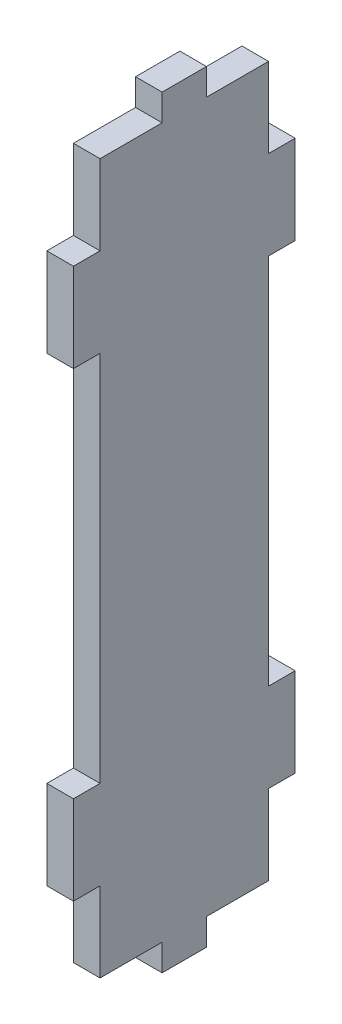
ISO-10303-21;
HEADER;
FILE_DESCRIPTION(('STEP AP214'),'2;1');
FILE_NAME('part.step','',(''),(''),'','','');
FILE_SCHEMA(('AUTOMOTIVE_DESIGN { 1 0 10303 214 1 1 1 1 }'));
ENDSEC;
DATA;
#1=APPLICATION_CONTEXT('core data for automotive mechanical design processes');
#2=APPLICATION_PROTOCOL_DEFINITION('international standard','automotive_design',2000,#1);
#3=PRODUCT_CONTEXT('',#1,'mechanical');
#4=PRODUCT('Part','Part','',(#3));
#5=PRODUCT_RELATED_PRODUCT_CATEGORY('part','',(#4));
#6=PRODUCT_DEFINITION_FORMATION('','',#4);
#7=PRODUCT_DEFINITION_CONTEXT('part definition',#1,'design');
#8=PRODUCT_DEFINITION('design','',#6,#7);
#9=PRODUCT_DEFINITION_SHAPE('','',#8);
#10=(LENGTH_UNIT() NAMED_UNIT(*) SI_UNIT(.MILLI.,.METRE.));
#11=(NAMED_UNIT(*) PLANE_ANGLE_UNIT() SI_UNIT($,.RADIAN.));
#12=(NAMED_UNIT(*) SI_UNIT($,.STERADIAN.) SOLID_ANGLE_UNIT());
#13=UNCERTAINTY_MEASURE_WITH_UNIT(LENGTH_MEASURE(1.E-05),#10,'distance_accuracy_value','');
#14=(GEOMETRIC_REPRESENTATION_CONTEXT(3) GLOBAL_UNCERTAINTY_ASSIGNED_CONTEXT((#13)) GLOBAL_UNIT_ASSIGNED_CONTEXT((#10,
#11,#12)) REPRESENTATION_CONTEXT('',''));
#15=CARTESIAN_POINT('',(0.,0.,0.));
#16=DIRECTION('',(0.,0.,1.));
#17=DIRECTION('',(1.,0.,0.));
#18=AXIS2_PLACEMENT_3D('',#15,#16,#17);
#19=CARTESIAN_POINT('',(3.,0.,0.));
#20=DIRECTION('',(0.,1.,0.));
#21=DIRECTION('',(0.,0.,1.));
#22=AXIS2_PLACEMENT_3D('',#19,#20,#21);
#23=PLANE('',#22);
#24=DIRECTION('',(0.,0.,-1.));
#25=VECTOR('',#24,1.);
#26=CARTESIAN_POINT('',(3.,0.,0.));
#27=LINE('',#26,#25);
#28=CARTESIAN_POINT('',(3.,0.,-10.));
#29=VERTEX_POINT('',#28);
#30=CARTESIAN_POINT('',(3.,0.,-15.));
#31=VERTEX_POINT('',#30);
#32=EDGE_CURVE('E418',#29,#31,#27,.T.);
#33=ORIENTED_EDGE('',*,*,#32,.F.);
#34=DIRECTION('',(1.,0.,0.));
#35=VECTOR('',#34,1.);
#36=CARTESIAN_POINT('',(0.,0.,-10.));
#37=LINE('',#36,#35);
#38=CARTESIAN_POINT('',(0.,0.,-10.));
#39=VERTEX_POINT('',#38);
#40=EDGE_CURVE('E284',#39,#29,#37,.T.);
#41=ORIENTED_EDGE('',*,*,#40,.F.);
#42=DIRECTION('',(0.,0.,-1.));
#43=VECTOR('',#42,1.);
#44=CARTESIAN_POINT('',(0.,0.,0.));
#45=LINE('',#44,#43);
#46=CARTESIAN_POINT('',(0.,0.,-15.));
#47=VERTEX_POINT('',#46);
#48=EDGE_CURVE('E427',#39,#47,#45,.T.);
#49=ORIENTED_EDGE('',*,*,#48,.T.);
#50=DIRECTION('',(1.,0.,0.));
#51=VECTOR('',#50,1.);
#52=CARTESIAN_POINT('',(0.,0.,-15.));
#53=LINE('',#52,#51);
#54=EDGE_CURVE('E227',#47,#31,#53,.T.);
#55=ORIENTED_EDGE('',*,*,#54,.T.);
#56=EDGE_LOOP('',(#33,#41,#49,#55));
#57=FACE_BOUND('',#56,.T.);
#58=ADVANCED_FACE('F34',(#57),#23,.F.);
#59=CARTESIAN_POINT('',(3.,86.,0.));
#60=DIRECTION('',(0.,-1.,0.));
#61=DIRECTION('',(0.,0.,-1.));
#62=AXIS2_PLACEMENT_3D('',#59,#60,#61);
#63=PLANE('',#62);
#64=DIRECTION('',(0.,0.,1.));
#65=VECTOR('',#64,1.);
#66=CARTESIAN_POINT('',(3.,86.,0.));
#67=LINE('',#66,#65);
#68=CARTESIAN_POINT('',(3.,86.,-15.));
#69=VERTEX_POINT('',#68);
#70=CARTESIAN_POINT('',(3.,86.,-10.));
#71=VERTEX_POINT('',#70);
#72=EDGE_CURVE('E12',#69,#71,#67,.T.);
#73=ORIENTED_EDGE('',*,*,#72,.F.);
#74=DIRECTION('',(1.,0.,0.));
#75=VECTOR('',#74,1.);
#76=CARTESIAN_POINT('',(0.,86.,-15.));
#77=LINE('',#76,#75);
#78=CARTESIAN_POINT('',(0.,86.,-15.));
#79=VERTEX_POINT('',#78);
#80=EDGE_CURVE('E260',#79,#69,#77,.T.);
#81=ORIENTED_EDGE('',*,*,#80,.F.);
#82=DIRECTION('',(0.,0.,1.));
#83=VECTOR('',#82,1.);
#84=CARTESIAN_POINT('',(0.,86.,0.));
#85=LINE('',#84,#83);
#86=CARTESIAN_POINT('',(0.,86.,-10.));
#87=VERTEX_POINT('',#86);
#88=EDGE_CURVE('E38',#79,#87,#85,.T.);
#89=ORIENTED_EDGE('',*,*,#88,.T.);
#90=DIRECTION('',(1.,0.,0.));
#91=VECTOR('',#90,1.);
#92=CARTESIAN_POINT('',(0.,86.,-10.));
#93=LINE('',#92,#91);
#94=EDGE_CURVE('E291',#87,#71,#93,.T.);
#95=ORIENTED_EDGE('',*,*,#94,.T.);
#96=EDGE_LOOP('',(#73,#81,#89,#95));
#97=FACE_BOUND('',#96,.T.);
#98=ADVANCED_FACE('F443',(#97),#63,.F.);
#99=CARTESIAN_POINT('',(3.,0.,0.));
#100=DIRECTION('',(-1.,0.,0.));
#101=DIRECTION('',(0.,0.,1.));
#102=AXIS2_PLACEMENT_3D('',#99,#100,#101);
#103=PLANE('',#102);
#104=DIRECTION('',(0.,-1.,0.));
#105=VECTOR('',#104,1.);
#106=CARTESIAN_POINT('',(3.,86.,-22.));
#107=LINE('',#106,#105);
#108=CARTESIAN_POINT('',(3.,83.,-22.));
#109=VERTEX_POINT('',#108);
#110=CARTESIAN_POINT('',(3.,74.,-22.));
#111=VERTEX_POINT('',#110);
#112=EDGE_CURVE('E336',#109,#111,#107,.T.);
#113=ORIENTED_EDGE('',*,*,#112,.F.);
#114=DIRECTION('',(0.,0.,-1.));
#115=VECTOR('',#114,1.);
#116=CARTESIAN_POINT('',(3.,83.,0.));
#117=LINE('',#116,#115);
#118=CARTESIAN_POINT('',(3.,83.,-15.));
#119=VERTEX_POINT('',#118);
#120=EDGE_CURVE('E258',#119,#109,#117,.T.);
#121=ORIENTED_EDGE('',*,*,#120,.F.);
#122=DIRECTION('',(0.,-1.,0.));
#123=VECTOR('',#122,1.);
#124=CARTESIAN_POINT('',(3.,0.,-15.));
#125=LINE('',#124,#123);
#126=EDGE_CURVE('E261',#69,#119,#125,.T.);
#127=ORIENTED_EDGE('',*,*,#126,.F.);
#128=ORIENTED_EDGE('',*,*,#72,.T.);
#129=DIRECTION('',(0.,-1.,0.));
#130=VECTOR('',#129,1.);
#131=CARTESIAN_POINT('',(3.,0.,-10.));
#132=LINE('',#131,#130);
#133=CARTESIAN_POINT('',(3.,83.,-10.));
#134=VERTEX_POINT('',#133);
#135=EDGE_CURVE('E269',#71,#134,#132,.T.);
#136=ORIENTED_EDGE('',*,*,#135,.T.);
#137=DIRECTION('',(0.,0.,-1.));
#138=VECTOR('',#137,1.);
#139=CARTESIAN_POINT('',(3.,83.,0.));
#140=LINE('',#139,#138);
#141=CARTESIAN_POINT('',(3.,83.,-3.));
#142=VERTEX_POINT('',#141);
#143=EDGE_CURVE('E289',#142,#134,#140,.T.);
#144=ORIENTED_EDGE('',*,*,#143,.F.);
#145=DIRECTION('',(0.,1.,0.));
#146=VECTOR('',#145,1.);
#147=CARTESIAN_POINT('',(3.,86.,-3.));
#148=LINE('',#147,#146);
#149=CARTESIAN_POINT('',(3.,74.,-3.));
#150=VERTEX_POINT('',#149);
#151=EDGE_CURVE('E402',#150,#142,#148,.T.);
#152=ORIENTED_EDGE('',*,*,#151,.F.);
#153=DIRECTION('',(0.,0.,-1.));
#154=VECTOR('',#153,1.);
#155=CARTESIAN_POINT('',(3.,74.,0.));
#156=LINE('',#155,#154);
#157=CARTESIAN_POINT('',(3.,74.,0.));
#158=VERTEX_POINT('',#157);
#159=EDGE_CURVE('E343',#158,#150,#156,.T.);
#160=ORIENTED_EDGE('',*,*,#159,.F.);
#161=DIRECTION('',(0.,-1.,0.));
#162=VECTOR('',#161,1.);
#163=CARTESIAN_POINT('',(3.,0.,0.));
#164=LINE('',#163,#162);
#165=CARTESIAN_POINT('',(3.,64.,0.));
#166=VERTEX_POINT('',#165);
#167=EDGE_CURVE('E417',#158,#166,#164,.T.);
#168=ORIENTED_EDGE('',*,*,#167,.T.);
#169=DIRECTION('',(0.,0.,1.));
#170=VECTOR('',#169,1.);
#171=CARTESIAN_POINT('',(3.,64.,0.));
#172=LINE('',#171,#170);
#173=CARTESIAN_POINT('',(3.,64.,-3.));
#174=VERTEX_POINT('',#173);
#175=EDGE_CURVE('E378',#174,#166,#172,.T.);
#176=ORIENTED_EDGE('',*,*,#175,.F.);
#177=DIRECTION('',(0.,1.,0.));
#178=VECTOR('',#177,1.);
#179=CARTESIAN_POINT('',(3.,64.,-3.));
#180=LINE('',#179,#178);
#181=CARTESIAN_POINT('',(3.,22.,-3.00000000000001));
#182=VERTEX_POINT('',#181);
#183=EDGE_CURVE('E387',#182,#174,#180,.T.);
#184=ORIENTED_EDGE('',*,*,#183,.F.);
#185=DIRECTION('',(0.,0.,-1.));
#186=VECTOR('',#185,1.);
#187=CARTESIAN_POINT('',(3.,22.,0.));
#188=LINE('',#187,#186);
#189=CARTESIAN_POINT('',(3.,22.,0.));
#190=VERTEX_POINT('',#189);
#191=EDGE_CURVE('E323',#190,#182,#188,.T.);
#192=ORIENTED_EDGE('',*,*,#191,.F.);
#193=CARTESIAN_POINT('',(3.,12.,0.));
#194=VERTEX_POINT('',#193);
#195=EDGE_CURVE('E414',#190,#194,#164,.T.);
#196=ORIENTED_EDGE('',*,*,#195,.T.);
#197=DIRECTION('',(0.,0.,1.));
#198=VECTOR('',#197,1.);
#199=CARTESIAN_POINT('',(3.,12.,0.));
#200=LINE('',#199,#198);
#201=CARTESIAN_POINT('',(3.,12.,-3.));
#202=VERTEX_POINT('',#201);
#203=EDGE_CURVE('E362',#202,#194,#200,.T.);
#204=ORIENTED_EDGE('',*,*,#203,.F.);
#205=DIRECTION('',(0.,1.,0.));
#206=VECTOR('',#205,1.);
#207=CARTESIAN_POINT('',(3.,0.,-3.));
#208=LINE('',#207,#206);
#209=CARTESIAN_POINT('',(3.,3.,-3.));
#210=VERTEX_POINT('',#209);
#211=EDGE_CURVE('E366',#210,#202,#208,.T.);
#212=ORIENTED_EDGE('',*,*,#211,.F.);
#213=DIRECTION('',(0.,0.,-1.));
#214=VECTOR('',#213,1.);
#215=CARTESIAN_POINT('',(3.,3.,0.));
#216=LINE('',#215,#214);
#217=CARTESIAN_POINT('',(3.,3.,-10.));
#218=VERTEX_POINT('',#217);
#219=EDGE_CURVE('E59',#210,#218,#216,.T.);
#220=ORIENTED_EDGE('',*,*,#219,.T.);
#221=DIRECTION('',(0.,1.,0.));
#222=VECTOR('',#221,1.);
#223=CARTESIAN_POINT('',(3.,0.,-10.));
#224=LINE('',#223,#222);
#225=EDGE_CURVE('E276',#29,#218,#224,.T.);
#226=ORIENTED_EDGE('',*,*,#225,.F.);
#227=ORIENTED_EDGE('',*,*,#32,.T.);
#228=DIRECTION('',(0.,1.,0.));
#229=VECTOR('',#228,1.);
#230=CARTESIAN_POINT('',(3.,0.,-15.));
#231=LINE('',#230,#229);
#232=CARTESIAN_POINT('',(3.,3.,-15.));
#233=VERTEX_POINT('',#232);
#234=EDGE_CURVE('E246',#31,#233,#231,.T.);
#235=ORIENTED_EDGE('',*,*,#234,.T.);
#236=DIRECTION('',(0.,0.,-1.));
#237=VECTOR('',#236,1.);
#238=CARTESIAN_POINT('',(3.,3.,0.));
#239=LINE('',#238,#237);
#240=CARTESIAN_POINT('',(3.,3.,-22.));
#241=VERTEX_POINT('',#240);
#242=EDGE_CURVE('E238',#233,#241,#239,.T.);
#243=ORIENTED_EDGE('',*,*,#242,.T.);
#244=DIRECTION('',(0.,-1.,0.));
#245=VECTOR('',#244,1.);
#246=CARTESIAN_POINT('',(3.,0.,-22.));
#247=LINE('',#246,#245);
#248=CARTESIAN_POINT('',(3.,12.,-22.));
#249=VERTEX_POINT('',#248);
#250=EDGE_CURVE('E348',#249,#241,#247,.T.);
#251=ORIENTED_EDGE('',*,*,#250,.F.);
#252=DIRECTION('',(0.,0.,1.));
#253=VECTOR('',#252,1.);
#254=CARTESIAN_POINT('',(3.,12.,-25.));
#255=LINE('',#254,#253);
#256=CARTESIAN_POINT('',(3.,12.,-25.));
#257=VERTEX_POINT('',#256);
#258=EDGE_CURVE('E351',#257,#249,#255,.T.);
#259=ORIENTED_EDGE('',*,*,#258,.F.);
#260=DIRECTION('',(0.,1.,0.));
#261=VECTOR('',#260,1.);
#262=CARTESIAN_POINT('',(3.,0.,-25.));
#263=LINE('',#262,#261);
#264=CARTESIAN_POINT('',(3.,22.,-25.));
#265=VERTEX_POINT('',#264);
#266=EDGE_CURVE('E43',#257,#265,#263,.T.);
#267=ORIENTED_EDGE('',*,*,#266,.T.);
#268=DIRECTION('',(0.,0.,-1.));
#269=VECTOR('',#268,1.);
#270=CARTESIAN_POINT('',(3.,22.,-25.));
#271=LINE('',#270,#269);
#272=CARTESIAN_POINT('',(3.,22.,-22.));
#273=VERTEX_POINT('',#272);
#274=EDGE_CURVE('E307',#273,#265,#271,.T.);
#275=ORIENTED_EDGE('',*,*,#274,.F.);
#276=DIRECTION('',(0.,-1.,0.));
#277=VECTOR('',#276,1.);
#278=CARTESIAN_POINT('',(3.,64.,-22.));
#279=LINE('',#278,#277);
#280=CARTESIAN_POINT('',(3.,64.,-22.));
#281=VERTEX_POINT('',#280);
#282=EDGE_CURVE('E316',#281,#273,#279,.T.);
#283=ORIENTED_EDGE('',*,*,#282,.F.);
#284=DIRECTION('',(0.,0.,1.));
#285=VECTOR('',#284,1.);
#286=CARTESIAN_POINT('',(3.,64.,-25.));
#287=LINE('',#286,#285);
#288=CARTESIAN_POINT('',(3.,64.,-25.));
#289=VERTEX_POINT('',#288);
#290=EDGE_CURVE('E298',#289,#281,#287,.T.);
#291=ORIENTED_EDGE('',*,*,#290,.F.);
#292=CARTESIAN_POINT('',(3.,74.,-25.));
#293=VERTEX_POINT('',#292);
#294=EDGE_CURVE('E421',#289,#293,#263,.T.);
#295=ORIENTED_EDGE('',*,*,#294,.T.);
#296=DIRECTION('',(0.,0.,-1.));
#297=VECTOR('',#296,1.);
#298=CARTESIAN_POINT('',(3.,74.,-25.));
#299=LINE('',#298,#297);
#300=EDGE_CURVE('E332',#111,#293,#299,.T.);
#301=ORIENTED_EDGE('',*,*,#300,.F.);
#302=EDGE_LOOP('',(#113,#121,#127,#128,#136,#144,#152,#160,#168,#176,#184,#192,#196,#204,#212,
#220,#226,#227,#235,#243,#251,#259,#267,#275,#283,#291,#295,#301));
#303=FACE_BOUND('',#302,.T.);
#304=ADVANCED_FACE('F452',(#303),#103,.F.);
#305=CARTESIAN_POINT('',(0.,0.,0.));
#306=DIRECTION('',(-1.,0.,0.));
#307=DIRECTION('',(0.,0.,1.));
#308=AXIS2_PLACEMENT_3D('',#305,#306,#307);
#309=PLANE('',#308);
#310=DIRECTION('',(0.,0.,-1.));
#311=VECTOR('',#310,1.);
#312=CARTESIAN_POINT('',(0.,83.,0.));
#313=LINE('',#312,#311);
#314=CARTESIAN_POINT('',(0.,83.,-15.));
#315=VERTEX_POINT('',#314);
#316=CARTESIAN_POINT('',(0.,83.,-22.));
#317=VERTEX_POINT('',#316);
#318=EDGE_CURVE('E257',#315,#317,#313,.T.);
#319=ORIENTED_EDGE('',*,*,#318,.T.);
#320=DIRECTION('',(0.,-1.,0.));
#321=VECTOR('',#320,1.);
#322=CARTESIAN_POINT('',(0.,86.,-22.));
#323=LINE('',#322,#321);
#324=CARTESIAN_POINT('',(0.,74.,-22.));
#325=VERTEX_POINT('',#324);
#326=EDGE_CURVE('E329',#317,#325,#323,.T.);
#327=ORIENTED_EDGE('',*,*,#326,.T.);
#328=DIRECTION('',(0.,0.,-1.));
#329=VECTOR('',#328,1.);
#330=CARTESIAN_POINT('',(0.,74.,-25.));
#331=LINE('',#330,#329);
#332=CARTESIAN_POINT('',(0.,74.,-25.));
#333=VERTEX_POINT('',#332);
#334=EDGE_CURVE('E331',#325,#333,#331,.T.);
#335=ORIENTED_EDGE('',*,*,#334,.T.);
#336=DIRECTION('',(0.,1.,0.));
#337=VECTOR('',#336,1.);
#338=CARTESIAN_POINT('',(0.,0.,-25.));
#339=LINE('',#338,#337);
#340=CARTESIAN_POINT('',(0.,64.,-25.));
#341=VERTEX_POINT('',#340);
#342=EDGE_CURVE('E428',#341,#333,#339,.T.);
#343=ORIENTED_EDGE('',*,*,#342,.F.);
#344=DIRECTION('',(0.,0.,1.));
#345=VECTOR('',#344,1.);
#346=CARTESIAN_POINT('',(0.,64.,-25.));
#347=LINE('',#346,#345);
#348=CARTESIAN_POINT('',(0.,64.,-22.));
#349=VERTEX_POINT('',#348);
#350=EDGE_CURVE('E303',#341,#349,#347,.T.);
#351=ORIENTED_EDGE('',*,*,#350,.T.);
#352=DIRECTION('',(0.,-1.,0.));
#353=VECTOR('',#352,1.);
#354=CARTESIAN_POINT('',(0.,64.,-22.));
#355=LINE('',#354,#353);
#356=CARTESIAN_POINT('',(0.,22.,-22.));
#357=VERTEX_POINT('',#356);
#358=EDGE_CURVE('E306',#349,#357,#355,.T.);
#359=ORIENTED_EDGE('',*,*,#358,.T.);
#360=DIRECTION('',(0.,0.,-1.));
#361=VECTOR('',#360,1.);
#362=CARTESIAN_POINT('',(0.,22.,-25.));
#363=LINE('',#362,#361);
#364=CARTESIAN_POINT('',(0.,22.,-25.));
#365=VERTEX_POINT('',#364);
#366=EDGE_CURVE('E310',#357,#365,#363,.T.);
#367=ORIENTED_EDGE('',*,*,#366,.T.);
#368=CARTESIAN_POINT('',(0.,12.,-25.));
#369=VERTEX_POINT('',#368);
#370=EDGE_CURVE('E430',#369,#365,#339,.T.);
#371=ORIENTED_EDGE('',*,*,#370,.F.);
#372=DIRECTION('',(0.,0.,1.));
#373=VECTOR('',#372,1.);
#374=CARTESIAN_POINT('',(0.,12.,-25.));
#375=LINE('',#374,#373);
#376=CARTESIAN_POINT('',(0.,12.,-22.));
#377=VERTEX_POINT('',#376);
#378=EDGE_CURVE('E346',#369,#377,#375,.T.);
#379=ORIENTED_EDGE('',*,*,#378,.T.);
#380=DIRECTION('',(0.,-1.,0.));
#381=VECTOR('',#380,1.);
#382=CARTESIAN_POINT('',(0.,0.,-22.));
#383=LINE('',#382,#381);
#384=CARTESIAN_POINT('',(0.,3.,-22.));
#385=VERTEX_POINT('',#384);
#386=EDGE_CURVE('E245',#377,#385,#383,.T.);
#387=ORIENTED_EDGE('',*,*,#386,.T.);
#388=DIRECTION('',(0.,0.,-1.));
#389=VECTOR('',#388,1.);
#390=CARTESIAN_POINT('',(0.,3.,0.));
#391=LINE('',#390,#389);
#392=CARTESIAN_POINT('',(0.,3.,-15.));
#393=VERTEX_POINT('',#392);
#394=EDGE_CURVE('E232',#393,#385,#391,.T.);
#395=ORIENTED_EDGE('',*,*,#394,.F.);
#396=DIRECTION('',(0.,1.,0.));
#397=VECTOR('',#396,1.);
#398=CARTESIAN_POINT('',(0.,0.,-15.));
#399=LINE('',#398,#397);
#400=EDGE_CURVE('E221',#47,#393,#399,.T.);
#401=ORIENTED_EDGE('',*,*,#400,.F.);
#402=ORIENTED_EDGE('',*,*,#48,.F.);
#403=DIRECTION('',(0.,1.,0.));
#404=VECTOR('',#403,1.);
#405=CARTESIAN_POINT('',(0.,0.,-10.));
#406=LINE('',#405,#404);
#407=CARTESIAN_POINT('',(0.,3.,-10.));
#408=VERTEX_POINT('',#407);
#409=EDGE_CURVE('E275',#39,#408,#406,.T.);
#410=ORIENTED_EDGE('',*,*,#409,.T.);
#411=DIRECTION('',(0.,0.,-1.));
#412=VECTOR('',#411,1.);
#413=CARTESIAN_POINT('',(0.,3.,0.));
#414=LINE('',#413,#412);
#415=CARTESIAN_POINT('',(0.,3.,-3.));
#416=VERTEX_POINT('',#415);
#417=EDGE_CURVE('E273',#416,#408,#414,.T.);
#418=ORIENTED_EDGE('',*,*,#417,.F.);
#419=DIRECTION('',(0.,1.,0.));
#420=VECTOR('',#419,1.);
#421=CARTESIAN_POINT('',(0.,0.,-3.));
#422=LINE('',#421,#420);
#423=CARTESIAN_POINT('',(0.,12.,-3.));
#424=VERTEX_POINT('',#423);
#425=EDGE_CURVE('E359',#416,#424,#422,.T.);
#426=ORIENTED_EDGE('',*,*,#425,.T.);
#427=DIRECTION('',(0.,0.,1.));
#428=VECTOR('',#427,1.);
#429=CARTESIAN_POINT('',(0.,12.,0.));
#430=LINE('',#429,#428);
#431=CARTESIAN_POINT('',(0.,12.,0.));
#432=VERTEX_POINT('',#431);
#433=EDGE_CURVE('E361',#424,#432,#430,.T.);
#434=ORIENTED_EDGE('',*,*,#433,.T.);
#435=DIRECTION('',(0.,-1.,0.));
#436=VECTOR('',#435,1.);
#437=CARTESIAN_POINT('',(0.,0.,0.));
#438=LINE('',#437,#436);
#439=CARTESIAN_POINT('',(0.,22.,0.));
#440=VERTEX_POINT('',#439);
#441=EDGE_CURVE('E412',#440,#432,#438,.T.);
#442=ORIENTED_EDGE('',*,*,#441,.F.);
#443=DIRECTION('',(0.,0.,-1.));
#444=VECTOR('',#443,1.);
#445=CARTESIAN_POINT('',(0.,22.,0.));
#446=LINE('',#445,#444);
#447=CARTESIAN_POINT('',(0.,22.,-3.00000000000001));
#448=VERTEX_POINT('',#447);
#449=EDGE_CURVE('E374',#440,#448,#446,.T.);
#450=ORIENTED_EDGE('',*,*,#449,.T.);
#451=DIRECTION('',(0.,1.,0.));
#452=VECTOR('',#451,1.);
#453=CARTESIAN_POINT('',(0.,64.,-3.));
#454=LINE('',#453,#452);
#455=CARTESIAN_POINT('',(0.,64.,-3.));
#456=VERTEX_POINT('',#455);
#457=EDGE_CURVE('E377',#448,#456,#454,.T.);
#458=ORIENTED_EDGE('',*,*,#457,.T.);
#459=DIRECTION('',(0.,0.,1.));
#460=VECTOR('',#459,1.);
#461=CARTESIAN_POINT('',(0.,64.,0.));
#462=LINE('',#461,#460);
#463=CARTESIAN_POINT('',(0.,64.,0.));
#464=VERTEX_POINT('',#463);
#465=EDGE_CURVE('E381',#456,#464,#462,.T.);
#466=ORIENTED_EDGE('',*,*,#465,.T.);
#467=CARTESIAN_POINT('',(0.,74.,0.));
#468=VERTEX_POINT('',#467);
#469=EDGE_CURVE('E426',#468,#464,#438,.T.);
#470=ORIENTED_EDGE('',*,*,#469,.F.);
#471=DIRECTION('',(0.,0.,-1.));
#472=VECTOR('',#471,1.);
#473=CARTESIAN_POINT('',(0.,74.,0.));
#474=LINE('',#473,#472);
#475=CARTESIAN_POINT('',(0.,74.,-3.));
#476=VERTEX_POINT('',#475);
#477=EDGE_CURVE('E398',#468,#476,#474,.T.);
#478=ORIENTED_EDGE('',*,*,#477,.T.);
#479=DIRECTION('',(0.,1.,0.));
#480=VECTOR('',#479,1.);
#481=CARTESIAN_POINT('',(0.,86.,-3.));
#482=LINE('',#481,#480);
#483=CARTESIAN_POINT('',(0.,83.,-3.));
#484=VERTEX_POINT('',#483);
#485=EDGE_CURVE('E401',#476,#484,#482,.T.);
#486=ORIENTED_EDGE('',*,*,#485,.T.);
#487=DIRECTION('',(0.,0.,-1.));
#488=VECTOR('',#487,1.);
#489=CARTESIAN_POINT('',(0.,83.,0.));
#490=LINE('',#489,#488);
#491=CARTESIAN_POINT('',(0.,83.,-10.));
#492=VERTEX_POINT('',#491);
#493=EDGE_CURVE('E51',#484,#492,#490,.T.);
#494=ORIENTED_EDGE('',*,*,#493,.T.);
#495=DIRECTION('',(0.,-1.,0.));
#496=VECTOR('',#495,1.);
#497=CARTESIAN_POINT('',(0.,0.,-10.));
#498=LINE('',#497,#496);
#499=EDGE_CURVE('E287',#87,#492,#498,.T.);
#500=ORIENTED_EDGE('',*,*,#499,.F.);
#501=ORIENTED_EDGE('',*,*,#88,.F.);
#502=DIRECTION('',(0.,-1.,0.));
#503=VECTOR('',#502,1.);
#504=CARTESIAN_POINT('',(0.,0.,-15.));
#505=LINE('',#504,#503);
#506=EDGE_CURVE('E254',#79,#315,#505,.T.);
#507=ORIENTED_EDGE('',*,*,#506,.T.);
#508=EDGE_LOOP('',(#319,#327,#335,#343,#351,#359,#367,#371,#379,#387,#395,#401,#402,#410,#418,
#426,#434,#442,#450,#458,#466,#470,#478,#486,#494,#500,#501,#507));
#509=FACE_BOUND('',#508,.T.);
#510=ADVANCED_FACE('F243',(#509),#309,.T.);
#511=CARTESIAN_POINT('',(0.,0.,-3.));
#512=DIRECTION('',(0.,0.,-1.));
#513=DIRECTION('',(0.,1.,0.));
#514=AXIS2_PLACEMENT_3D('',#511,#512,#513);
#515=PLANE('',#514);
#516=DIRECTION('',(1.,0.,0.));
#517=VECTOR('',#516,1.);
#518=CARTESIAN_POINT('',(0.,3.,-3.));
#519=LINE('',#518,#517);
#520=EDGE_CURVE('E279',#416,#210,#519,.T.);
#521=ORIENTED_EDGE('',*,*,#520,.T.);
#522=ORIENTED_EDGE('',*,*,#211,.T.);
#523=DIRECTION('',(1.,0.,0.));
#524=VECTOR('',#523,1.);
#525=CARTESIAN_POINT('',(0.,12.,-3.));
#526=LINE('',#525,#524);
#527=EDGE_CURVE('E365',#424,#202,#526,.T.);
#528=ORIENTED_EDGE('',*,*,#527,.F.);
#529=ORIENTED_EDGE('',*,*,#425,.F.);
#530=EDGE_LOOP('',(#521,#522,#528,#529));
#531=FACE_BOUND('',#530,.T.);
#532=ADVANCED_FACE('F493',(#531),#515,.F.);
#533=CARTESIAN_POINT('',(0.,0.,-22.));
#534=DIRECTION('',(0.,0.,1.));
#535=DIRECTION('',(1.,0.,0.));
#536=AXIS2_PLACEMENT_3D('',#533,#534,#535);
#537=PLANE('',#536);
#538=DIRECTION('',(1.,0.,0.));
#539=VECTOR('',#538,1.);
#540=CARTESIAN_POINT('',(0.,3.,-22.));
#541=LINE('',#540,#539);
#542=EDGE_CURVE('E251',#385,#241,#541,.T.);
#543=ORIENTED_EDGE('',*,*,#542,.F.);
#544=ORIENTED_EDGE('',*,*,#386,.F.);
#545=DIRECTION('',(1.,0.,0.));
#546=VECTOR('',#545,1.);
#547=CARTESIAN_POINT('',(0.,12.,-22.));
#548=LINE('',#547,#546);
#549=EDGE_CURVE('E338',#377,#249,#548,.T.);
#550=ORIENTED_EDGE('',*,*,#549,.T.);
#551=ORIENTED_EDGE('',*,*,#250,.T.);
#552=EDGE_LOOP('',(#543,#544,#550,#551));
#553=FACE_BOUND('',#552,.T.);
#554=ADVANCED_FACE('F490',(#553),#537,.F.);
#555=CARTESIAN_POINT('',(3.,0.,0.));
#556=DIRECTION('',(0.,0.,-1.));
#557=DIRECTION('',(-1.,0.,0.));
#558=AXIS2_PLACEMENT_3D('',#555,#556,#557);
#559=PLANE('',#558);
#560=ORIENTED_EDGE('',*,*,#469,.T.);
#561=DIRECTION('',(1.,0.,0.));
#562=VECTOR('',#561,1.);
#563=CARTESIAN_POINT('',(0.,64.,0.));
#564=LINE('',#563,#562);
#565=EDGE_CURVE('E368',#464,#166,#564,.T.);
#566=ORIENTED_EDGE('',*,*,#565,.T.);
#567=ORIENTED_EDGE('',*,*,#167,.F.);
#568=DIRECTION('',(1.,0.,0.));
#569=VECTOR('',#568,1.);
#570=CARTESIAN_POINT('',(0.,74.,0.));
#571=LINE('',#570,#569);
#572=EDGE_CURVE('E405',#468,#158,#571,.T.);
#573=ORIENTED_EDGE('',*,*,#572,.F.);
#574=EDGE_LOOP('',(#560,#566,#567,#573));
#575=FACE_BOUND('',#574,.T.);
#576=ADVANCED_FACE('F492',(#575),#559,.F.);
#577=CARTESIAN_POINT('',(3.,0.,-25.));
#578=DIRECTION('',(0.,0.,1.));
#579=DIRECTION('',(1.,0.,0.));
#580=AXIS2_PLACEMENT_3D('',#577,#578,#579);
#581=PLANE('',#580);
#582=ORIENTED_EDGE('',*,*,#266,.F.);
#583=DIRECTION('',(1.,0.,0.));
#584=VECTOR('',#583,1.);
#585=CARTESIAN_POINT('',(0.,12.,-25.));
#586=LINE('',#585,#584);
#587=EDGE_CURVE('E350',#369,#257,#586,.T.);
#588=ORIENTED_EDGE('',*,*,#587,.F.);
#589=ORIENTED_EDGE('',*,*,#370,.T.);
#590=DIRECTION('',(1.,0.,0.));
#591=VECTOR('',#590,1.);
#592=CARTESIAN_POINT('',(0.,22.,-25.));
#593=LINE('',#592,#591);
#594=EDGE_CURVE('E320',#365,#265,#593,.T.);
#595=ORIENTED_EDGE('',*,*,#594,.T.);
#596=EDGE_LOOP('',(#582,#588,#589,#595));
#597=FACE_BOUND('',#596,.T.);
#598=ADVANCED_FACE('F486',(#597),#581,.F.);
#599=ORIENTED_EDGE('',*,*,#441,.T.);
#600=DIRECTION('',(1.,0.,0.));
#601=VECTOR('',#600,1.);
#602=CARTESIAN_POINT('',(0.,12.,0.));
#603=LINE('',#602,#601);
#604=EDGE_CURVE('E354',#432,#194,#603,.T.);
#605=ORIENTED_EDGE('',*,*,#604,.T.);
#606=ORIENTED_EDGE('',*,*,#195,.F.);
#607=DIRECTION('',(1.,0.,0.));
#608=VECTOR('',#607,1.);
#609=CARTESIAN_POINT('',(0.,22.,0.));
#610=LINE('',#609,#608);
#611=EDGE_CURVE('E384',#440,#190,#610,.T.);
#612=ORIENTED_EDGE('',*,*,#611,.F.);
#613=EDGE_LOOP('',(#599,#605,#606,#612));
#614=FACE_BOUND('',#613,.T.);
#615=ADVANCED_FACE('F36',(#614),#559,.F.);
#616=ORIENTED_EDGE('',*,*,#342,.T.);
#617=DIRECTION('',(1.,0.,0.));
#618=VECTOR('',#617,1.);
#619=CARTESIAN_POINT('',(0.,74.,-25.));
#620=LINE('',#619,#618);
#621=EDGE_CURVE('E340',#333,#293,#620,.T.);
#622=ORIENTED_EDGE('',*,*,#621,.T.);
#623=ORIENTED_EDGE('',*,*,#294,.F.);
#624=DIRECTION('',(1.,0.,0.));
#625=VECTOR('',#624,1.);
#626=CARTESIAN_POINT('',(0.,64.,-25.));
#627=LINE('',#626,#625);
#628=EDGE_CURVE('E313',#341,#289,#627,.T.);
#629=ORIENTED_EDGE('',*,*,#628,.F.);
#630=EDGE_LOOP('',(#616,#622,#623,#629));
#631=FACE_BOUND('',#630,.T.);
#632=ADVANCED_FACE('F471',(#631),#581,.F.);
#633=CARTESIAN_POINT('',(0.,86.,-3.));
#634=DIRECTION('',(0.,0.,-1.));
#635=DIRECTION('',(0.,1.,0.));
#636=AXIS2_PLACEMENT_3D('',#633,#634,#635);
#637=PLANE('',#636);
#638=ORIENTED_EDGE('',*,*,#151,.T.);
#639=DIRECTION('',(1.,0.,0.));
#640=VECTOR('',#639,1.);
#641=CARTESIAN_POINT('',(0.,83.,-3.));
#642=LINE('',#641,#640);
#643=EDGE_CURVE('E299',#484,#142,#642,.T.);
#644=ORIENTED_EDGE('',*,*,#643,.F.);
#645=ORIENTED_EDGE('',*,*,#485,.F.);
#646=DIRECTION('',(1.,0.,0.));
#647=VECTOR('',#646,1.);
#648=CARTESIAN_POINT('',(0.,74.,-3.));
#649=LINE('',#648,#647);
#650=EDGE_CURVE('E410',#476,#150,#649,.T.);
#651=ORIENTED_EDGE('',*,*,#650,.T.);
#652=EDGE_LOOP('',(#638,#644,#645,#651));
#653=FACE_BOUND('',#652,.T.);
#654=ADVANCED_FACE('F513',(#653),#637,.F.);
#655=CARTESIAN_POINT('',(0.,74.,0.));
#656=DIRECTION('',(0.,-1.,0.));
#657=DIRECTION('',(0.,0.,-1.));
#658=AXIS2_PLACEMENT_3D('',#655,#656,#657);
#659=PLANE('',#658);
#660=ORIENTED_EDGE('',*,*,#159,.T.);
#661=ORIENTED_EDGE('',*,*,#650,.F.);
#662=ORIENTED_EDGE('',*,*,#477,.F.);
#663=ORIENTED_EDGE('',*,*,#572,.T.);
#664=EDGE_LOOP('',(#660,#661,#662,#663));
#665=FACE_BOUND('',#664,.T.);
#666=ADVANCED_FACE('F519',(#665),#659,.F.);
#667=CARTESIAN_POINT('',(0.,22.,-25.));
#668=DIRECTION('',(0.,-1.,0.));
#669=DIRECTION('',(0.,0.,-1.));
#670=AXIS2_PLACEMENT_3D('',#667,#668,#669);
#671=PLANE('',#670);
#672=ORIENTED_EDGE('',*,*,#274,.T.);
#673=ORIENTED_EDGE('',*,*,#594,.F.);
#674=ORIENTED_EDGE('',*,*,#366,.F.);
#675=DIRECTION('',(1.,0.,0.));
#676=VECTOR('',#675,1.);
#677=CARTESIAN_POINT('',(0.,22.,-22.));
#678=LINE('',#677,#676);
#679=EDGE_CURVE('E324',#357,#273,#678,.T.);
#680=ORIENTED_EDGE('',*,*,#679,.T.);
#681=EDGE_LOOP('',(#672,#673,#674,#680));
#682=FACE_BOUND('',#681,.T.);
#683=ADVANCED_FACE('F480',(#682),#671,.F.);
#684=CARTESIAN_POINT('',(0.,64.,-22.));
#685=DIRECTION('',(0.,0.,1.));
#686=DIRECTION('',(0.,-1.,0.));
#687=AXIS2_PLACEMENT_3D('',#684,#685,#686);
#688=PLANE('',#687);
#689=ORIENTED_EDGE('',*,*,#282,.T.);
#690=ORIENTED_EDGE('',*,*,#679,.F.);
#691=ORIENTED_EDGE('',*,*,#358,.F.);
#692=DIRECTION('',(1.,0.,0.));
#693=VECTOR('',#692,1.);
#694=CARTESIAN_POINT('',(0.,64.,-22.));
#695=LINE('',#694,#693);
#696=EDGE_CURVE('E326',#349,#281,#695,.T.);
#697=ORIENTED_EDGE('',*,*,#696,.T.);
#698=EDGE_LOOP('',(#689,#690,#691,#697));
#699=FACE_BOUND('',#698,.T.);
#700=ADVANCED_FACE('F476',(#699),#688,.F.);
#701=CARTESIAN_POINT('',(0.,64.,-25.));
#702=DIRECTION('',(0.,1.,0.));
#703=DIRECTION('',(0.,0.,1.));
#704=AXIS2_PLACEMENT_3D('',#701,#702,#703);
#705=PLANE('',#704);
#706=ORIENTED_EDGE('',*,*,#290,.T.);
#707=ORIENTED_EDGE('',*,*,#696,.F.);
#708=ORIENTED_EDGE('',*,*,#350,.F.);
#709=ORIENTED_EDGE('',*,*,#628,.T.);
#710=EDGE_LOOP('',(#706,#707,#708,#709));
#711=FACE_BOUND('',#710,.T.);
#712=ADVANCED_FACE('F474',(#711),#705,.F.);
#713=CARTESIAN_POINT('',(0.,64.,0.));
#714=DIRECTION('',(0.,1.,0.));
#715=DIRECTION('',(0.,0.,1.));
#716=AXIS2_PLACEMENT_3D('',#713,#714,#715);
#717=PLANE('',#716);
#718=ORIENTED_EDGE('',*,*,#175,.T.);
#719=ORIENTED_EDGE('',*,*,#565,.F.);
#720=ORIENTED_EDGE('',*,*,#465,.F.);
#721=DIRECTION('',(1.,0.,0.));
#722=VECTOR('',#721,1.);
#723=CARTESIAN_POINT('',(0.,64.,-3.));
#724=LINE('',#723,#722);
#725=EDGE_CURVE('E393',#456,#174,#724,.T.);
#726=ORIENTED_EDGE('',*,*,#725,.T.);
#727=EDGE_LOOP('',(#718,#719,#720,#726));
#728=FACE_BOUND('',#727,.T.);
#729=ADVANCED_FACE('F534',(#728),#717,.F.);
#730=CARTESIAN_POINT('',(0.,64.,-3.));
#731=DIRECTION('',(0.,0.,-1.));
#732=DIRECTION('',(0.,1.,0.));
#733=AXIS2_PLACEMENT_3D('',#730,#731,#732);
#734=PLANE('',#733);
#735=ORIENTED_EDGE('',*,*,#183,.T.);
#736=ORIENTED_EDGE('',*,*,#725,.F.);
#737=ORIENTED_EDGE('',*,*,#457,.F.);
#738=DIRECTION('',(1.,0.,0.));
#739=VECTOR('',#738,1.);
#740=CARTESIAN_POINT('',(0.,22.,-3.00000000000001));
#741=LINE('',#740,#739);
#742=EDGE_CURVE('E395',#448,#182,#741,.T.);
#743=ORIENTED_EDGE('',*,*,#742,.T.);
#744=EDGE_LOOP('',(#735,#736,#737,#743));
#745=FACE_BOUND('',#744,.T.);
#746=ADVANCED_FACE('F530',(#745),#734,.F.);
#747=CARTESIAN_POINT('',(0.,22.,0.));
#748=DIRECTION('',(0.,-1.,0.));
#749=DIRECTION('',(0.,0.,-1.));
#750=AXIS2_PLACEMENT_3D('',#747,#748,#749);
#751=PLANE('',#750);
#752=ORIENTED_EDGE('',*,*,#191,.T.);
#753=ORIENTED_EDGE('',*,*,#742,.F.);
#754=ORIENTED_EDGE('',*,*,#449,.F.);
#755=ORIENTED_EDGE('',*,*,#611,.T.);
#756=EDGE_LOOP('',(#752,#753,#754,#755));
#757=FACE_BOUND('',#756,.T.);
#758=ADVANCED_FACE('F526',(#757),#751,.F.);
#759=CARTESIAN_POINT('',(0.,12.,0.));
#760=DIRECTION('',(0.,1.,0.));
#761=DIRECTION('',(0.,0.,1.));
#762=AXIS2_PLACEMENT_3D('',#759,#760,#761);
#763=PLANE('',#762);
#764=ORIENTED_EDGE('',*,*,#203,.T.);
#765=ORIENTED_EDGE('',*,*,#604,.F.);
#766=ORIENTED_EDGE('',*,*,#433,.F.);
#767=ORIENTED_EDGE('',*,*,#527,.T.);
#768=EDGE_LOOP('',(#764,#765,#766,#767));
#769=FACE_BOUND('',#768,.T.);
#770=ADVANCED_FACE('F529',(#769),#763,.F.);
#771=CARTESIAN_POINT('',(0.,12.,-25.));
#772=DIRECTION('',(0.,1.,0.));
#773=DIRECTION('',(0.,0.,1.));
#774=AXIS2_PLACEMENT_3D('',#771,#772,#773);
#775=PLANE('',#774);
#776=ORIENTED_EDGE('',*,*,#258,.T.);
#777=ORIENTED_EDGE('',*,*,#549,.F.);
#778=ORIENTED_EDGE('',*,*,#378,.F.);
#779=ORIENTED_EDGE('',*,*,#587,.T.);
#780=EDGE_LOOP('',(#776,#777,#778,#779));
#781=FACE_BOUND('',#780,.T.);
#782=ADVANCED_FACE('F483',(#781),#775,.F.);
#783=CARTESIAN_POINT('',(0.,74.,-25.));
#784=DIRECTION('',(0.,-1.,0.));
#785=DIRECTION('',(0.,0.,-1.));
#786=AXIS2_PLACEMENT_3D('',#783,#784,#785);
#787=PLANE('',#786);
#788=ORIENTED_EDGE('',*,*,#300,.T.);
#789=ORIENTED_EDGE('',*,*,#621,.F.);
#790=ORIENTED_EDGE('',*,*,#334,.F.);
#791=DIRECTION('',(1.,0.,0.));
#792=VECTOR('',#791,1.);
#793=CARTESIAN_POINT('',(0.,74.,-22.));
#794=LINE('',#793,#792);
#795=EDGE_CURVE('E335',#325,#111,#794,.T.);
#796=ORIENTED_EDGE('',*,*,#795,.T.);
#797=EDGE_LOOP('',(#788,#789,#790,#796));
#798=FACE_BOUND('',#797,.T.);
#799=ADVANCED_FACE('F467',(#798),#787,.F.);
#800=CARTESIAN_POINT('',(0.,86.,-22.));
#801=DIRECTION('',(0.,0.,1.));
#802=DIRECTION('',(1.,0.,0.));
#803=AXIS2_PLACEMENT_3D('',#800,#801,#802);
#804=PLANE('',#803);
#805=ORIENTED_EDGE('',*,*,#326,.F.);
#806=DIRECTION('',(1.,0.,0.));
#807=VECTOR('',#806,1.);
#808=CARTESIAN_POINT('',(0.,83.,-22.));
#809=LINE('',#808,#807);
#810=EDGE_CURVE('E266',#317,#109,#809,.T.);
#811=ORIENTED_EDGE('',*,*,#810,.T.);
#812=ORIENTED_EDGE('',*,*,#112,.T.);
#813=ORIENTED_EDGE('',*,*,#795,.F.);
#814=EDGE_LOOP('',(#805,#811,#812,#813));
#815=FACE_BOUND('',#814,.T.);
#816=ADVANCED_FACE('F464',(#815),#804,.F.);
#817=CARTESIAN_POINT('',(0.,83.,0.));
#818=DIRECTION('',(0.,-1.,0.));
#819=DIRECTION('',(0.,0.,-1.));
#820=AXIS2_PLACEMENT_3D('',#817,#818,#819);
#821=PLANE('',#820);
#822=ORIENTED_EDGE('',*,*,#120,.T.);
#823=ORIENTED_EDGE('',*,*,#810,.F.);
#824=ORIENTED_EDGE('',*,*,#318,.F.);
#825=DIRECTION('',(1.,0.,0.));
#826=VECTOR('',#825,1.);
#827=CARTESIAN_POINT('',(0.,83.,-15.));
#828=LINE('',#827,#826);
#829=EDGE_CURVE('E270',#315,#119,#828,.T.);
#830=ORIENTED_EDGE('',*,*,#829,.T.);
#831=EDGE_LOOP('',(#822,#823,#824,#830));
#832=FACE_BOUND('',#831,.T.);
#833=ADVANCED_FACE('F459',(#832),#821,.F.);
#834=CARTESIAN_POINT('',(0.,0.,-15.));
#835=DIRECTION('',(0.,0.,1.));
#836=DIRECTION('',(1.,0.,0.));
#837=AXIS2_PLACEMENT_3D('',#834,#835,#836);
#838=PLANE('',#837);
#839=ORIENTED_EDGE('',*,*,#126,.T.);
#840=ORIENTED_EDGE('',*,*,#829,.F.);
#841=ORIENTED_EDGE('',*,*,#506,.F.);
#842=ORIENTED_EDGE('',*,*,#80,.T.);
#843=EDGE_LOOP('',(#839,#840,#841,#842));
#844=FACE_BOUND('',#843,.T.);
#845=ADVANCED_FACE('F456',(#844),#838,.F.);
#846=CARTESIAN_POINT('',(0.,3.,0.));
#847=DIRECTION('',(0.,-1.,0.));
#848=DIRECTION('',(0.,0.,-1.));
#849=AXIS2_PLACEMENT_3D('',#846,#847,#848);
#850=PLANE('',#849);
#851=ORIENTED_EDGE('',*,*,#242,.F.);
#852=DIRECTION('',(1.,0.,0.));
#853=VECTOR('',#852,1.);
#854=CARTESIAN_POINT('',(0.,3.,-15.));
#855=LINE('',#854,#853);
#856=EDGE_CURVE('E224',#393,#233,#855,.T.);
#857=ORIENTED_EDGE('',*,*,#856,.F.);
#858=ORIENTED_EDGE('',*,*,#394,.T.);
#859=ORIENTED_EDGE('',*,*,#542,.T.);
#860=EDGE_LOOP('',(#851,#857,#858,#859));
#861=FACE_BOUND('',#860,.T.);
#862=ADVANCED_FACE('F235',(#861),#850,.T.);
#863=CARTESIAN_POINT('',(0.,0.,-15.));
#864=DIRECTION('',(0.,0.,-1.));
#865=DIRECTION('',(-1.,0.,0.));
#866=AXIS2_PLACEMENT_3D('',#863,#864,#865);
#867=PLANE('',#866);
#868=ORIENTED_EDGE('',*,*,#234,.F.);
#869=ORIENTED_EDGE('',*,*,#54,.F.);
#870=ORIENTED_EDGE('',*,*,#400,.T.);
#871=ORIENTED_EDGE('',*,*,#856,.T.);
#872=EDGE_LOOP('',(#868,#869,#870,#871));
#873=FACE_BOUND('',#872,.T.);
#874=ADVANCED_FACE('F223',(#873),#867,.T.);
#875=CARTESIAN_POINT('',(0.,3.,0.));
#876=DIRECTION('',(0.,-1.,0.));
#877=DIRECTION('',(0.,0.,-1.));
#878=AXIS2_PLACEMENT_3D('',#875,#876,#877);
#879=PLANE('',#878);
#880=ORIENTED_EDGE('',*,*,#219,.F.);
#881=ORIENTED_EDGE('',*,*,#520,.F.);
#882=ORIENTED_EDGE('',*,*,#417,.T.);
#883=DIRECTION('',(1.,0.,0.));
#884=VECTOR('',#883,1.);
#885=CARTESIAN_POINT('',(0.,3.,-10.));
#886=LINE('',#885,#884);
#887=EDGE_CURVE('E264',#408,#218,#886,.T.);
#888=ORIENTED_EDGE('',*,*,#887,.T.);
#889=EDGE_LOOP('',(#880,#881,#882,#888));
#890=FACE_BOUND('',#889,.T.);
#891=ADVANCED_FACE('F561',(#890),#879,.T.);
#892=CARTESIAN_POINT('',(0.,0.,-10.));
#893=DIRECTION('',(0.,0.,-1.));
#894=DIRECTION('',(-1.,0.,0.));
#895=AXIS2_PLACEMENT_3D('',#892,#893,#894);
#896=PLANE('',#895);
#897=ORIENTED_EDGE('',*,*,#225,.T.);
#898=ORIENTED_EDGE('',*,*,#887,.F.);
#899=ORIENTED_EDGE('',*,*,#409,.F.);
#900=ORIENTED_EDGE('',*,*,#40,.T.);
#901=EDGE_LOOP('',(#897,#898,#899,#900));
#902=FACE_BOUND('',#901,.T.);
#903=ADVANCED_FACE('F558',(#902),#896,.F.);
#904=CARTESIAN_POINT('',(0.,0.,-10.));
#905=DIRECTION('',(0.,0.,1.));
#906=DIRECTION('',(1.,0.,0.));
#907=AXIS2_PLACEMENT_3D('',#904,#905,#906);
#908=PLANE('',#907);
#909=ORIENTED_EDGE('',*,*,#135,.F.);
#910=ORIENTED_EDGE('',*,*,#94,.F.);
#911=ORIENTED_EDGE('',*,*,#499,.T.);
#912=DIRECTION('',(1.,0.,0.));
#913=VECTOR('',#912,1.);
#914=CARTESIAN_POINT('',(0.,83.,-10.));
#915=LINE('',#914,#913);
#916=EDGE_CURVE('E296',#492,#134,#915,.T.);
#917=ORIENTED_EDGE('',*,*,#916,.T.);
#918=EDGE_LOOP('',(#909,#910,#911,#917));
#919=FACE_BOUND('',#918,.T.);
#920=ADVANCED_FACE('F446',(#919),#908,.T.);
#921=CARTESIAN_POINT('',(0.,83.,0.));
#922=DIRECTION('',(0.,-1.,0.));
#923=DIRECTION('',(0.,0.,-1.));
#924=AXIS2_PLACEMENT_3D('',#921,#922,#923);
#925=PLANE('',#924);
#926=ORIENTED_EDGE('',*,*,#143,.T.);
#927=ORIENTED_EDGE('',*,*,#916,.F.);
#928=ORIENTED_EDGE('',*,*,#493,.F.);
#929=ORIENTED_EDGE('',*,*,#643,.T.);
#930=EDGE_LOOP('',(#926,#927,#928,#929));
#931=FACE_BOUND('',#930,.T.);
#932=ADVANCED_FACE('F447',(#931),#925,.F.);
#933=CLOSED_SHELL('',(#58,#98,#304,#510,#532,#554,#576,#598,#615,#632,#654,#666,#683,#700,#712,
#729,#746,#758,#770,#782,#799,#816,#833,#845,#862,#874,#891,#903,#920,#932));
#934=MANIFOLD_SOLID_BREP('B2',#933);
#935=ADVANCED_BREP_SHAPE_REPRESENTATION('',(#18,#934),#14);
#936=SHAPE_DEFINITION_REPRESENTATION(#9,#935);
ENDSEC;
END-ISO-10303-21;
